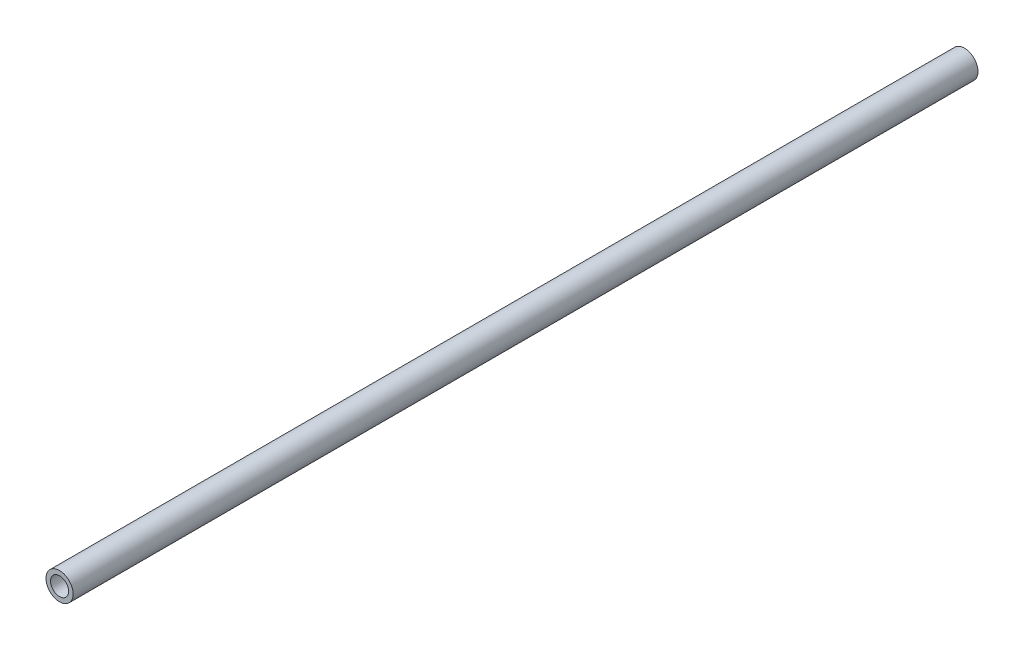
ISO-10303-21;
HEADER;
FILE_DESCRIPTION(('STEP AP214'),'2;1');
FILE_NAME('part.step','',(''),(''),'','','');
FILE_SCHEMA(('AUTOMOTIVE_DESIGN { 1 0 10303 214 1 1 1 1 }'));
ENDSEC;
DATA;
#1=APPLICATION_CONTEXT('core data for automotive mechanical design processes');
#2=APPLICATION_PROTOCOL_DEFINITION('international standard','automotive_design',2000,#1);
#3=PRODUCT_CONTEXT('',#1,'mechanical');
#4=PRODUCT('Part','Part','',(#3));
#5=PRODUCT_RELATED_PRODUCT_CATEGORY('part','',(#4));
#6=PRODUCT_DEFINITION_FORMATION('','',#4);
#7=PRODUCT_DEFINITION_CONTEXT('part definition',#1,'design');
#8=PRODUCT_DEFINITION('design','',#6,#7);
#9=PRODUCT_DEFINITION_SHAPE('','',#8);
#10=(LENGTH_UNIT() NAMED_UNIT(*) SI_UNIT(.MILLI.,.METRE.));
#11=(NAMED_UNIT(*) PLANE_ANGLE_UNIT() SI_UNIT($,.RADIAN.));
#12=(NAMED_UNIT(*) SI_UNIT($,.STERADIAN.) SOLID_ANGLE_UNIT());
#13=UNCERTAINTY_MEASURE_WITH_UNIT(LENGTH_MEASURE(1.E-05),#10,'distance_accuracy_value','');
#14=(GEOMETRIC_REPRESENTATION_CONTEXT(3) GLOBAL_UNCERTAINTY_ASSIGNED_CONTEXT((#13)) GLOBAL_UNIT_ASSIGNED_CONTEXT((#10,
#11,#12)) REPRESENTATION_CONTEXT('',''));
#15=CARTESIAN_POINT('',(0.,0.,0.));
#16=DIRECTION('',(0.,0.,1.));
#17=DIRECTION('',(1.,0.,0.));
#18=AXIS2_PLACEMENT_3D('',#15,#16,#17);
#19=CARTESIAN_POINT('',(0.,0.,1000.));
#20=DIRECTION('',(0.,0.,1.));
#21=DIRECTION('',(1.,0.,0.));
#22=AXIS2_PLACEMENT_3D('',#19,#20,#21);
#23=PLANE('',#22);
#24=CARTESIAN_POINT('',(0.,0.,1000.));
#25=DIRECTION('',(0.,0.,1.));
#26=DIRECTION('',(1.,0.,0.));
#27=AXIS2_PLACEMENT_3D('',#24,#25,#26);
#28=CIRCLE('',#27,15.);
#29=CARTESIAN_POINT('',(15.,0.,1000.));
#30=VERTEX_POINT('',#29);
#31=EDGE_CURVE('E11',#30,#30,#28,.T.);
#32=ORIENTED_EDGE('',*,*,#31,.T.);
#33=EDGE_LOOP('',(#32));
#34=FACE_BOUND('',#33,.T.);
#35=CARTESIAN_POINT('',(0.,0.,1000.));
#36=DIRECTION('',(0.,0.,1.));
#37=DIRECTION('',(1.,0.,0.));
#38=AXIS2_PLACEMENT_3D('',#35,#36,#37);
#39=CIRCLE('',#38,10.);
#40=CARTESIAN_POINT('',(10.,0.,1000.));
#41=VERTEX_POINT('',#40);
#42=EDGE_CURVE('E52',#41,#41,#39,.T.);
#43=ORIENTED_EDGE('',*,*,#42,.F.);
#44=EDGE_LOOP('',(#43));
#45=FACE_BOUND('',#44,.T.);
#46=ADVANCED_FACE('F41',(#34,#45),#23,.T.);
#47=CARTESIAN_POINT('',(0.,0.,0.));
#48=DIRECTION('',(0.,0.,1.));
#49=DIRECTION('',(1.,0.,0.));
#50=AXIS2_PLACEMENT_3D('',#47,#48,#49);
#51=PLANE('',#50);
#52=CARTESIAN_POINT('',(0.,0.,0.));
#53=DIRECTION('',(0.,0.,1.));
#54=DIRECTION('',(1.,0.,0.));
#55=AXIS2_PLACEMENT_3D('',#52,#53,#54);
#56=CIRCLE('',#55,15.);
#57=CARTESIAN_POINT('',(15.,0.,0.));
#58=VERTEX_POINT('',#57);
#59=EDGE_CURVE('E45',#58,#58,#56,.T.);
#60=ORIENTED_EDGE('',*,*,#59,.F.);
#61=EDGE_LOOP('',(#60));
#62=FACE_BOUND('',#61,.T.);
#63=CARTESIAN_POINT('',(0.,0.,0.));
#64=DIRECTION('',(0.,0.,1.));
#65=DIRECTION('',(1.,0.,0.));
#66=AXIS2_PLACEMENT_3D('',#63,#64,#65);
#67=CIRCLE('',#66,10.);
#68=CARTESIAN_POINT('',(10.,0.,0.));
#69=VERTEX_POINT('',#68);
#70=EDGE_CURVE('E54',#69,#69,#67,.T.);
#71=ORIENTED_EDGE('',*,*,#70,.T.);
#72=EDGE_LOOP('',(#71));
#73=FACE_BOUND('',#72,.T.);
#74=ADVANCED_FACE('F64',(#62,#73),#51,.F.);
#75=CARTESIAN_POINT('',(0.,0.,1000.));
#76=DIRECTION('',(0.,0.,-1.));
#77=DIRECTION('',(-1.,0.,0.));
#78=AXIS2_PLACEMENT_3D('',#75,#76,#77);
#79=CYLINDRICAL_SURFACE('',#78,15.);
#80=ORIENTED_EDGE('',*,*,#31,.F.);
#81=EDGE_LOOP('',(#80));
#82=FACE_BOUND('',#81,.T.);
#83=ORIENTED_EDGE('',*,*,#59,.T.);
#84=EDGE_LOOP('',(#83));
#85=FACE_BOUND('',#84,.T.);
#86=ADVANCED_FACE('F43',(#82,#85),#79,.T.);
#87=CARTESIAN_POINT('',(0.,0.,1000.));
#88=DIRECTION('',(0.,0.,-1.));
#89=DIRECTION('',(-1.,0.,0.));
#90=AXIS2_PLACEMENT_3D('',#87,#88,#89);
#91=CYLINDRICAL_SURFACE('',#90,10.);
#92=ORIENTED_EDGE('',*,*,#42,.T.);
#93=EDGE_LOOP('',(#92));
#94=FACE_BOUND('',#93,.T.);
#95=ORIENTED_EDGE('',*,*,#70,.F.);
#96=EDGE_LOOP('',(#95));
#97=FACE_BOUND('',#96,.T.);
#98=ADVANCED_FACE('F60',(#94,#97),#91,.F.);
#99=CLOSED_SHELL('',(#46,#74,#86,#98));
#100=MANIFOLD_SOLID_BREP('B2',#99);
#101=ADVANCED_BREP_SHAPE_REPRESENTATION('',(#18,#100),#14);
#102=SHAPE_DEFINITION_REPRESENTATION(#9,#101);
ENDSEC;
END-ISO-10303-21;
